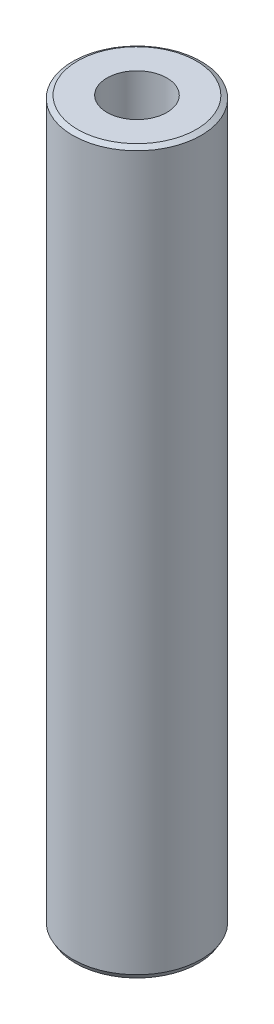
ISO-10303-21;
HEADER;
FILE_DESCRIPTION(('STEP AP214'),'2;1');
FILE_NAME('part.step','',(''),(''),'','','');
FILE_SCHEMA(('AUTOMOTIVE_DESIGN { 1 0 10303 214 1 1 1 1 }'));
ENDSEC;
DATA;
#1=APPLICATION_CONTEXT('core data for automotive mechanical design processes');
#2=APPLICATION_PROTOCOL_DEFINITION('international standard','automotive_design',2000,#1);
#3=PRODUCT_CONTEXT('',#1,'mechanical');
#4=PRODUCT('Part','Part','',(#3));
#5=PRODUCT_RELATED_PRODUCT_CATEGORY('part','',(#4));
#6=PRODUCT_DEFINITION_FORMATION('','',#4);
#7=PRODUCT_DEFINITION_CONTEXT('part definition',#1,'design');
#8=PRODUCT_DEFINITION('design','',#6,#7);
#9=PRODUCT_DEFINITION_SHAPE('','',#8);
#10=(LENGTH_UNIT() NAMED_UNIT(*) SI_UNIT(.MILLI.,.METRE.));
#11=(NAMED_UNIT(*) PLANE_ANGLE_UNIT() SI_UNIT($,.RADIAN.));
#12=(NAMED_UNIT(*) SI_UNIT($,.STERADIAN.) SOLID_ANGLE_UNIT());
#13=UNCERTAINTY_MEASURE_WITH_UNIT(LENGTH_MEASURE(1.E-05),#10,'distance_accuracy_value','');
#14=(GEOMETRIC_REPRESENTATION_CONTEXT(3) GLOBAL_UNCERTAINTY_ASSIGNED_CONTEXT((#13)) GLOBAL_UNIT_ASSIGNED_CONTEXT((#10,
#11,#12)) REPRESENTATION_CONTEXT('',''));
#15=CARTESIAN_POINT('',(0.,0.,0.));
#16=DIRECTION('',(0.,0.,1.));
#17=DIRECTION('',(1.,0.,0.));
#18=AXIS2_PLACEMENT_3D('',#15,#16,#17);
#19=CARTESIAN_POINT('',(0.,561.899542214199,0.));
#20=DIRECTION('',(0.,-1.,0.));
#21=DIRECTION('',(0.,0.,-1.));
#22=AXIS2_PLACEMENT_3D('',#19,#20,#21);
#23=CYLINDRICAL_SURFACE('',#22,50.);
#24=CARTESIAN_POINT('',(0.,559.740167377129,0.));
#25=DIRECTION('',(0.,1.,0.));
#26=DIRECTION('',(0.,0.,1.));
#27=AXIS2_PLACEMENT_3D('',#24,#25,#26);
#28=CIRCLE('',#27,50.);
#29=CARTESIAN_POINT('',(0.,559.740167377129,50.));
#30=VERTEX_POINT('',#29);
#31=EDGE_CURVE('E50',#30,#30,#28,.F.);
#32=ORIENTED_EDGE('',*,*,#31,.T.);
#33=EDGE_LOOP('',(#32));
#34=FACE_BOUND('',#33,.T.);
#35=CARTESIAN_POINT('',(0.,3.74014693039004,0.));
#36=DIRECTION('',(0.,1.,0.));
#37=DIRECTION('',(0.,0.,1.));
#38=AXIS2_PLACEMENT_3D('',#35,#36,#37);
#39=CIRCLE('',#38,50.);
#40=CARTESIAN_POINT('',(0.,3.74014693039004,50.));
#41=VERTEX_POINT('',#40);
#42=EDGE_CURVE('E51',#41,#41,#39,.T.);
#43=ORIENTED_EDGE('',*,*,#42,.T.);
#44=EDGE_LOOP('',(#43));
#45=FACE_BOUND('',#44,.T.);
#46=ADVANCED_FACE('F39',(#34,#45),#23,.T.);
#47=CARTESIAN_POINT('',(0.,561.899542214199,0.));
#48=DIRECTION('',(0.,1.,0.));
#49=DIRECTION('',(0.,0.,1.));
#50=AXIS2_PLACEMENT_3D('',#47,#48,#49);
#51=PLANE('',#50);
#52=CARTESIAN_POINT('',(0.,561.899542214199,0.));
#53=DIRECTION('',(0.,1.,0.));
#54=DIRECTION('',(0.,0.,1.));
#55=AXIS2_PLACEMENT_3D('',#52,#53,#54);
#56=CIRCLE('',#55,46.2598530696101);
#57=CARTESIAN_POINT('',(0.,561.899542214199,46.2598530696101));
#58=VERTEX_POINT('',#57);
#59=EDGE_CURVE('E54',#58,#58,#56,.T.);
#60=ORIENTED_EDGE('',*,*,#59,.T.);
#61=EDGE_LOOP('',(#60));
#62=FACE_BOUND('',#61,.T.);
#63=CARTESIAN_POINT('',(0.,561.899542214199,0.));
#64=DIRECTION('',(0.,1.,0.));
#65=DIRECTION('',(0.,0.,1.));
#66=AXIS2_PLACEMENT_3D('',#63,#64,#65);
#67=CIRCLE('',#66,23.3194141171426);
#68=CARTESIAN_POINT('',(0.,561.899542214199,23.3194141171426));
#69=VERTEX_POINT('',#68);
#70=EDGE_CURVE('E58',#69,#69,#67,.T.);
#71=ORIENTED_EDGE('',*,*,#70,.F.);
#72=EDGE_LOOP('',(#71));
#73=FACE_BOUND('',#72,.T.);
#74=ADVANCED_FACE('F69',(#62,#73),#51,.T.);
#75=CARTESIAN_POINT('',(0.,0.,0.));
#76=DIRECTION('',(0.,1.,0.));
#77=DIRECTION('',(0.,0.,1.));
#78=AXIS2_PLACEMENT_3D('',#75,#76,#77);
#79=PLANE('',#78);
#80=CARTESIAN_POINT('',(0.,0.,0.));
#81=DIRECTION('',(0.,1.,0.));
#82=DIRECTION('',(0.,0.,1.));
#83=AXIS2_PLACEMENT_3D('',#80,#81,#82);
#84=CIRCLE('',#83,47.8406251629305);
#85=CARTESIAN_POINT('',(0.,0.,47.8406251629305));
#86=VERTEX_POINT('',#85);
#87=EDGE_CURVE('E10',#86,#86,#84,.F.);
#88=ORIENTED_EDGE('',*,*,#87,.T.);
#89=EDGE_LOOP('',(#88));
#90=FACE_BOUND('',#89,.T.);
#91=CARTESIAN_POINT('',(0.,0.,0.));
#92=DIRECTION('',(0.,1.,0.));
#93=DIRECTION('',(0.,0.,1.));
#94=AXIS2_PLACEMENT_3D('',#91,#92,#93);
#95=CIRCLE('',#94,23.3194141171426);
#96=CARTESIAN_POINT('',(0.,0.,23.3194141171426));
#97=VERTEX_POINT('',#96);
#98=EDGE_CURVE('E63',#97,#97,#95,.T.);
#99=ORIENTED_EDGE('',*,*,#98,.T.);
#100=EDGE_LOOP('',(#99));
#101=FACE_BOUND('',#100,.T.);
#102=ADVANCED_FACE('F75',(#90,#101),#79,.F.);
#103=CARTESIAN_POINT('',(0.,561.899542214199,0.));
#104=DIRECTION('',(0.,-1.,0.));
#105=DIRECTION('',(0.,0.,-1.));
#106=AXIS2_PLACEMENT_3D('',#103,#104,#105);
#107=CYLINDRICAL_SURFACE('',#106,23.3194141171426);
#108=ORIENTED_EDGE('',*,*,#70,.T.);
#109=EDGE_LOOP('',(#108));
#110=FACE_BOUND('',#109,.T.);
#111=ORIENTED_EDGE('',*,*,#98,.F.);
#112=EDGE_LOOP('',(#111));
#113=FACE_BOUND('',#112,.T.);
#114=ADVANCED_FACE('F70',(#110,#113),#107,.F.);
#115=CARTESIAN_POINT('',(0.,561.899542214199,0.));
#116=DIRECTION('',(0.,-1.,0.));
#117=DIRECTION('',(0.,0.,-1.));
#118=AXIS2_PLACEMENT_3D('',#115,#116,#117);
#119=CONICAL_SURFACE('',#118,46.2598530696101,1.04719755119661);
#120=ORIENTED_EDGE('',*,*,#31,.F.);
#121=EDGE_LOOP('',(#120));
#122=FACE_BOUND('',#121,.T.);
#123=ORIENTED_EDGE('',*,*,#59,.F.);
#124=EDGE_LOOP('',(#123));
#125=FACE_BOUND('',#124,.T.);
#126=ADVANCED_FACE('F81',(#122,#125),#119,.T.);
#127=CARTESIAN_POINT('',(0.,3.74014693039004,0.));
#128=DIRECTION('',(0.,1.,0.));
#129=DIRECTION('',(0.,0.,1.));
#130=AXIS2_PLACEMENT_3D('',#127,#128,#129);
#131=CONICAL_SURFACE('',#130,50.,0.523598775598316);
#132=CARTESIAN_POINT('',(0.,0.,47.8406251629305));
#133=CARTESIAN_POINT('',(0.,0.0389598638582299,47.8631186508166));
#134=CARTESIAN_POINT('',(0.,0.0779197277164594,47.8856121387028));
#135=CARTESIAN_POINT('',(0.,0.155839455432918,47.930599114475));
#136=CARTESIAN_POINT('',(0.,0.194799319291148,47.9530926023612));
#137=CARTESIAN_POINT('',(0.,0.272719047007607,47.9980795781335));
#138=CARTESIAN_POINT('',(0.,0.311678910865836,48.0205730660196));
#139=CARTESIAN_POINT('',(0.,0.389598638582295,48.0655600417919));
#140=CARTESIAN_POINT('',(0.,0.428558502440526,48.088053529678));
#141=CARTESIAN_POINT('',(0.,0.506478230156985,48.1330405054503));
#142=CARTESIAN_POINT('',(0.,0.545438094015214,48.1555339933364));
#143=CARTESIAN_POINT('',(0.,0.623357821731673,48.2005209691087));
#144=CARTESIAN_POINT('',(0.,0.662317685589903,48.2230144569949));
#145=CARTESIAN_POINT('',(0.,0.740237413306363,48.2680014327671));
#146=CARTESIAN_POINT('',(0.,0.779197277164591,48.2904949206533));
#147=CARTESIAN_POINT('',(0.,0.85711700488105,48.3354818964256));
#148=CARTESIAN_POINT('',(0.,0.896076868739281,48.3579753843117));
#149=CARTESIAN_POINT('',(0.,0.973996596455741,48.402962360084));
#150=CARTESIAN_POINT('',(0.,1.01295646031397,48.4254558479701));
#151=CARTESIAN_POINT('',(0.,1.09087618803043,48.4704428237424));
#152=CARTESIAN_POINT('',(0.,1.12983605188866,48.4929363116286));
#153=CARTESIAN_POINT('',(0.,1.20775577960512,48.5379232874008));
#154=CARTESIAN_POINT('',(0.,1.24671564346335,48.560416775287));
#155=CARTESIAN_POINT('',(0.,1.32463537117981,48.6054037510593));
#156=CARTESIAN_POINT('',(0.,1.36359523503804,48.6278972389454));
#157=CARTESIAN_POINT('',(0.,1.44151496275449,48.6728842147177));
#158=CARTESIAN_POINT('',(0.,1.48047482661273,48.6953777026038));
#159=CARTESIAN_POINT('',(0.,1.55839455432918,48.7403646783761));
#160=CARTESIAN_POINT('',(0.,1.59735441818741,48.7628581662623));
#161=CARTESIAN_POINT('',(0.,1.67527414590387,48.8078451420345));
#162=CARTESIAN_POINT('',(0.,1.7142340097621,48.8303386299207));
#163=CARTESIAN_POINT('',(0.,1.79215373747856,48.875325605693));
#164=CARTESIAN_POINT('',(0.,1.83111360133679,48.8978190935791));
#165=CARTESIAN_POINT('',(0.,1.90903332905325,48.9428060693514));
#166=CARTESIAN_POINT('',(0.,1.94799319291148,48.9652995572375));
#167=CARTESIAN_POINT('',(0.,2.02591292062794,49.0102865330098));
#168=CARTESIAN_POINT('',(0.,2.06487278448617,49.0327800208959));
#169=CARTESIAN_POINT('',(0.,2.14279251220263,49.0777669966682));
#170=CARTESIAN_POINT('',(0.,2.18175237606086,49.1002604845544));
#171=CARTESIAN_POINT('',(0.,2.25967210377732,49.1452474603267));
#172=CARTESIAN_POINT('',(0.,2.29863196763555,49.1677409482128));
#173=CARTESIAN_POINT('',(0.,2.37655169535201,49.2127279239851));
#174=CARTESIAN_POINT('',(0.,2.41551155921024,49.2352214118712));
#175=CARTESIAN_POINT('',(0.,2.49343128692669,49.2802083876435));
#176=CARTESIAN_POINT('',(0.,2.53239115078493,49.3027018755296));
#177=CARTESIAN_POINT('',(0.,2.61031087850138,49.3476888513019));
#178=CARTESIAN_POINT('',(0.,2.64927074235961,49.3701823391881));
#179=CARTESIAN_POINT('',(0.,2.72719047007607,49.4151693149603));
#180=CARTESIAN_POINT('',(0.,2.7661503339343,49.4376628028465));
#181=CARTESIAN_POINT('',(0.,2.84407006165076,49.4826497786188));
#182=CARTESIAN_POINT('',(0.,2.88302992550899,49.5051432665049));
#183=CARTESIAN_POINT('',(0.,2.96094965322545,49.5501302422772));
#184=CARTESIAN_POINT('',(0.,2.99990951708368,49.5726237301633));
#185=CARTESIAN_POINT('',(0.,3.07782924480014,49.6176107059356));
#186=CARTESIAN_POINT('',(0.,3.11678910865837,49.6401041938217));
#187=CARTESIAN_POINT('',(0.,3.19470883637483,49.685091169594));
#188=CARTESIAN_POINT('',(0.,3.23366870023306,49.7075846574802));
#189=CARTESIAN_POINT('',(0.,3.31158842794952,49.7525716332525));
#190=CARTESIAN_POINT('',(0.,3.35054829180775,49.7750651211386));
#191=CARTESIAN_POINT('',(0.,3.42846801952421,49.8200520969109));
#192=CARTESIAN_POINT('',(0.,3.46742788338243,49.842545584797));
#193=CARTESIAN_POINT('',(0.,3.54534761109889,49.8875325605693));
#194=CARTESIAN_POINT('',(0.,3.58430747495712,49.9100260484554));
#195=CARTESIAN_POINT('',(0.,3.66222720267358,49.9550130242277));
#196=CARTESIAN_POINT('',(0.,3.70118706653181,49.9775065121139));
#197=CARTESIAN_POINT('',(0.,3.74014693039004,50.));
#198=B_SPLINE_CURVE_WITH_KNOTS('',3,(#132,#133,#134,#135,#136,#137,#138,#139,#140,#141,#142,
#143,#144,#145,#146,#147,#148,#149,#150,#151,#152,#153,#154,#155,#156,#157,#158,#159,#160,#161,
#162,#163,#164,#165,#166,#167,#168,#169,#170,#171,#172,#173,#174,#175,#176,#177,#178,#179,#180,
#181,#182,#183,#184,#185,#186,#187,#188,#189,#190,#191,#192,#193,#194,#195,#196,#197),
.UNSPECIFIED.,.F.,.F.,(4,2,2,2,2,2,2,2,2,2,2,2,2,2,2,2,2,2,2,2,2,2,2,2,2,2,2,2,2,2,2,2,4),(0.,
0.13496092731684,0.269921854633683,0.404882781950526,0.539843709267365,0.674804636584209,
0.809765563901048,0.944726491217891,1.07968741853473,1.21464834585157,1.34960927316842,
1.48457020048526,1.6195311278021,1.75449205511894,1.88945298243578,2.02441390975262,
2.15937483706946,2.2943357643863,2.42929669170315,2.56425761901999,2.69921854633683,
2.83417947365367,2.96914040097051,3.10410132828736,3.2390622556042,3.37402318292104,
3.50898411023788,3.64394503755472,3.77890596487156,3.9138668921884,4.04882781950525,
4.18378874682209,4.31874967413893),.UNSPECIFIED.);
#199=EDGE_CURVE('BSEAM45',#86,#41,#198,.T.);
#200=ORIENTED_EDGE('',*,*,#87,.F.);
#201=ORIENTED_EDGE('',*,*,#42,.F.);
#202=ORIENTED_EDGE('',*,*,#199,.T.);
#203=ORIENTED_EDGE('',*,*,#199,.F.);
#204=EDGE_LOOP('',(#200,#202,#201,#203));
#205=FACE_BOUND('',#204,.T.);
#206=ADVANCED_FACE('F45',(#205),#131,.T.);
#207=CLOSED_SHELL('',(#46,#74,#102,#114,#126,#206));
#208=MANIFOLD_SOLID_BREP('B2',#207);
#209=ADVANCED_BREP_SHAPE_REPRESENTATION('',(#18,#208),#14);
#210=SHAPE_DEFINITION_REPRESENTATION(#9,#209);
ENDSEC;
END-ISO-10303-21;
